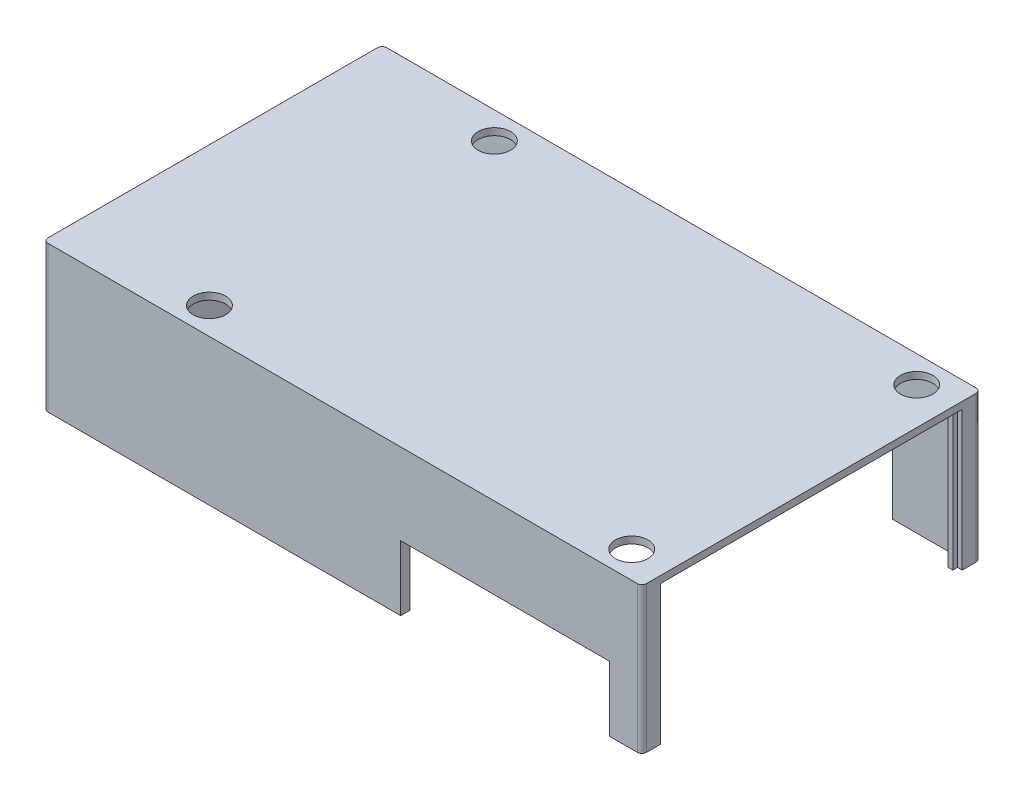
ISO-10303-21;
HEADER;
FILE_DESCRIPTION(('STEP AP214'),'2;1');
FILE_NAME('part.step','',(''),(''),'','','');
FILE_SCHEMA(('AUTOMOTIVE_DESIGN { 1 0 10303 214 1 1 1 1 }'));
ENDSEC;
DATA;
#1=APPLICATION_CONTEXT('core data for automotive mechanical design processes');
#2=APPLICATION_PROTOCOL_DEFINITION('international standard','automotive_design',2000,#1);
#3=PRODUCT_CONTEXT('',#1,'mechanical');
#4=PRODUCT('Part','Part','',(#3));
#5=PRODUCT_RELATED_PRODUCT_CATEGORY('part','',(#4));
#6=PRODUCT_DEFINITION_FORMATION('','',#4);
#7=PRODUCT_DEFINITION_CONTEXT('part definition',#1,'design');
#8=PRODUCT_DEFINITION('design','',#6,#7);
#9=PRODUCT_DEFINITION_SHAPE('','',#8);
#10=(LENGTH_UNIT() NAMED_UNIT(*) SI_UNIT(.MILLI.,.METRE.));
#11=(NAMED_UNIT(*) PLANE_ANGLE_UNIT() SI_UNIT($,.RADIAN.));
#12=(NAMED_UNIT(*) SI_UNIT($,.STERADIAN.) SOLID_ANGLE_UNIT());
#13=UNCERTAINTY_MEASURE_WITH_UNIT(LENGTH_MEASURE(1.E-05),#10,'distance_accuracy_value','');
#14=(GEOMETRIC_REPRESENTATION_CONTEXT(3) GLOBAL_UNCERTAINTY_ASSIGNED_CONTEXT((#13)) GLOBAL_UNIT_ASSIGNED_CONTEXT((#10,
#11,#12)) REPRESENTATION_CONTEXT('',''));
#15=CARTESIAN_POINT('',(0.,0.,0.));
#16=DIRECTION('',(0.,0.,1.));
#17=DIRECTION('',(1.,0.,0.));
#18=AXIS2_PLACEMENT_3D('',#15,#16,#17);
#19=CARTESIAN_POINT('',(0.,0.,0.));
#20=DIRECTION('',(0.,-1.,0.));
#21=DIRECTION('',(0.,0.,-1.));
#22=AXIS2_PLACEMENT_3D('',#19,#20,#21);
#23=PLANE('',#22);
#24=CARTESIAN_POINT('',(56.5,0.,-30.7));
#25=DIRECTION('',(0.,-1.,0.));
#26=DIRECTION('',(0.,0.,-1.));
#27=AXIS2_PLACEMENT_3D('',#24,#25,#26);
#28=CIRCLE('',#27,3.5);
#29=CARTESIAN_POINT('',(56.5,0.,-34.2));
#30=VERTEX_POINT('',#29);
#31=EDGE_CURVE('E357',#30,#30,#28,.T.);
#32=ORIENTED_EDGE('',*,*,#31,.F.);
#33=EDGE_LOOP('',(#32));
#34=FACE_BOUND('',#33,.T.);
#35=CARTESIAN_POINT('',(-34.5,0.,30.7));
#36=DIRECTION('',(0.,-1.,0.));
#37=DIRECTION('',(0.,0.,-1.));
#38=AXIS2_PLACEMENT_3D('',#35,#36,#37);
#39=CIRCLE('',#38,3.5);
#40=CARTESIAN_POINT('',(-34.5,0.,27.2));
#41=VERTEX_POINT('',#40);
#42=EDGE_CURVE('E353',#41,#41,#39,.T.);
#43=ORIENTED_EDGE('',*,*,#42,.F.);
#44=EDGE_LOOP('',(#43));
#45=FACE_BOUND('',#44,.T.);
#46=CARTESIAN_POINT('',(56.5,0.,30.7));
#47=DIRECTION('',(0.,-1.,0.));
#48=DIRECTION('',(0.,0.,-1.));
#49=AXIS2_PLACEMENT_3D('',#46,#47,#48);
#50=CIRCLE('',#49,3.50000000000001);
#51=CARTESIAN_POINT('',(56.5,0.,27.2));
#52=VERTEX_POINT('',#51);
#53=EDGE_CURVE('E349',#52,#52,#50,.T.);
#54=ORIENTED_EDGE('',*,*,#53,.F.);
#55=EDGE_LOOP('',(#54));
#56=FACE_BOUND('',#55,.T.);
#57=CARTESIAN_POINT('',(-34.5,0.,-30.7));
#58=DIRECTION('',(0.,-1.,0.));
#59=DIRECTION('',(0.,0.,-1.));
#60=AXIS2_PLACEMENT_3D('',#57,#58,#59);
#61=CIRCLE('',#60,3.5);
#62=CARTESIAN_POINT('',(-34.5,0.,-34.2));
#63=VERTEX_POINT('',#62);
#64=EDGE_CURVE('E345',#63,#63,#61,.T.);
#65=ORIENTED_EDGE('',*,*,#64,.F.);
#66=EDGE_LOOP('',(#65));
#67=FACE_BOUND('',#66,.T.);
#68=DIRECTION('',(0.,0.,1.));
#69=VECTOR('',#68,1.);
#70=CARTESIAN_POINT('',(63.5,0.,-31.5));
#71=LINE('',#70,#69);
#72=CARTESIAN_POINT('',(63.5,0.,-32.5));
#73=VERTEX_POINT('',#72);
#74=CARTESIAN_POINT('',(63.5,0.,-31.5));
#75=VERTEX_POINT('',#74);
#76=EDGE_CURVE('E55',#73,#75,#71,.T.);
#77=ORIENTED_EDGE('',*,*,#76,.F.);
#78=DIRECTION('',(-1.,0.,0.));
#79=VECTOR('',#78,1.);
#80=CARTESIAN_POINT('',(63.5,0.,-32.5));
#81=LINE('',#80,#79);
#82=CARTESIAN_POINT('',(64.5,0.,-32.5));
#83=VERTEX_POINT('',#82);
#84=EDGE_CURVE('E267',#83,#73,#81,.T.);
#85=ORIENTED_EDGE('',*,*,#84,.F.);
#86=DIRECTION('',(0.,0.,1.));
#87=VECTOR('',#86,1.);
#88=CARTESIAN_POINT('',(64.5,0.,-36.5));
#89=LINE('',#88,#87);
#90=CARTESIAN_POINT('',(64.5,0.,32.5));
#91=VERTEX_POINT('',#90);
#92=EDGE_CURVE('E240',#83,#91,#89,.T.);
#93=ORIENTED_EDGE('',*,*,#92,.T.);
#94=DIRECTION('',(1.,0.,0.));
#95=VECTOR('',#94,1.);
#96=CARTESIAN_POINT('',(63.5,0.,32.5));
#97=LINE('',#96,#95);
#98=CARTESIAN_POINT('',(63.5,0.,32.5));
#99=VERTEX_POINT('',#98);
#100=EDGE_CURVE('E290',#99,#91,#97,.T.);
#101=ORIENTED_EDGE('',*,*,#100,.F.);
#102=DIRECTION('',(0.,0.,1.));
#103=VECTOR('',#102,1.);
#104=CARTESIAN_POINT('',(63.5,0.,31.5));
#105=LINE('',#104,#103);
#106=CARTESIAN_POINT('',(63.5,0.,31.5));
#107=VERTEX_POINT('',#106);
#108=EDGE_CURVE('E306',#107,#99,#105,.T.);
#109=ORIENTED_EDGE('',*,*,#108,.F.);
#110=DIRECTION('',(1.,0.,0.));
#111=VECTOR('',#110,1.);
#112=CARTESIAN_POINT('',(62.5,0.,31.5));
#113=LINE('',#112,#111);
#114=CARTESIAN_POINT('',(62.5,0.,31.5));
#115=VERTEX_POINT('',#114);
#116=EDGE_CURVE('E303',#115,#107,#113,.T.);
#117=ORIENTED_EDGE('',*,*,#116,.F.);
#118=DIRECTION('',(0.,0.,-1.));
#119=VECTOR('',#118,1.);
#120=CARTESIAN_POINT('',(62.5,0.,34.5));
#121=LINE('',#120,#119);
#122=CARTESIAN_POINT('',(62.5,0.,34.5));
#123=VERTEX_POINT('',#122);
#124=EDGE_CURVE('E243',#123,#115,#121,.T.);
#125=ORIENTED_EDGE('',*,*,#124,.F.);
#126=DIRECTION('',(1.,0.,0.));
#127=VECTOR('',#126,1.);
#128=CARTESIAN_POINT('',(-64.5,0.,34.5));
#129=LINE('',#128,#127);
#130=CARTESIAN_POINT('',(-62.5,0.,34.5));
#131=VERTEX_POINT('',#130);
#132=EDGE_CURVE('E422',#131,#123,#129,.T.);
#133=ORIENTED_EDGE('',*,*,#132,.F.);
#134=DIRECTION('',(0.,0.,-1.));
#135=VECTOR('',#134,1.);
#136=CARTESIAN_POINT('',(-62.5,0.,34.5));
#137=LINE('',#136,#135);
#138=CARTESIAN_POINT('',(-62.5,0.,-34.5));
#139=VERTEX_POINT('',#138);
#140=EDGE_CURVE('E458',#131,#139,#137,.T.);
#141=ORIENTED_EDGE('',*,*,#140,.T.);
#142=DIRECTION('',(1.,0.,0.));
#143=VECTOR('',#142,1.);
#144=CARTESIAN_POINT('',(-64.5,0.,-34.5));
#145=LINE('',#144,#143);
#146=CARTESIAN_POINT('',(62.5,0.,-34.5));
#147=VERTEX_POINT('',#146);
#148=EDGE_CURVE('E447',#139,#147,#145,.T.);
#149=ORIENTED_EDGE('',*,*,#148,.T.);
#150=DIRECTION('',(0.,0.,-1.));
#151=VECTOR('',#150,1.);
#152=CARTESIAN_POINT('',(62.5,0.,-34.5));
#153=LINE('',#152,#151);
#154=CARTESIAN_POINT('',(62.5,0.,-31.5));
#155=VERTEX_POINT('',#154);
#156=EDGE_CURVE('E251',#155,#147,#153,.T.);
#157=ORIENTED_EDGE('',*,*,#156,.F.);
#158=DIRECTION('',(-1.,0.,0.));
#159=VECTOR('',#158,1.);
#160=CARTESIAN_POINT('',(62.5,0.,-31.5));
#161=LINE('',#160,#159);
#162=EDGE_CURVE('E60',#75,#155,#161,.T.);
#163=ORIENTED_EDGE('',*,*,#162,.F.);
#164=EDGE_LOOP('',(#77,#85,#93,#101,#109,#117,#125,#133,#141,#149,#157,#163));
#165=FACE_BOUND('',#164,.T.);
#166=ADVANCED_FACE('F39',(#34,#45,#56,#67,#165),#23,.T.);
#167=CARTESIAN_POINT('',(-64.5,-30.,-34.5));
#168=DIRECTION('',(0.,0.,1.));
#169=DIRECTION('',(1.,0.,0.));
#170=AXIS2_PLACEMENT_3D('',#167,#168,#169);
#171=PLANE('',#170);
#172=DIRECTION('',(1.,0.,0.));
#173=VECTOR('',#172,1.);
#174=CARTESIAN_POINT('',(-64.5,-30.,-34.5));
#175=LINE('',#174,#173);
#176=CARTESIAN_POINT('',(47.5,-30.,-34.5));
#177=VERTEX_POINT('',#176);
#178=CARTESIAN_POINT('',(62.5,-30.,-34.5));
#179=VERTEX_POINT('',#178);
#180=EDGE_CURVE('E232',#177,#179,#175,.T.);
#181=ORIENTED_EDGE('',*,*,#180,.T.);
#182=DIRECTION('',(0.,1.,0.));
#183=VECTOR('',#182,1.);
#184=CARTESIAN_POINT('',(62.5,-30.,-34.5));
#185=LINE('',#184,#183);
#186=EDGE_CURVE('E266',#179,#147,#185,.T.);
#187=ORIENTED_EDGE('',*,*,#186,.T.);
#188=ORIENTED_EDGE('',*,*,#148,.F.);
#189=DIRECTION('',(0.,1.,0.));
#190=VECTOR('',#189,1.);
#191=CARTESIAN_POINT('',(-62.5,-30.,-34.5));
#192=LINE('',#191,#190);
#193=CARTESIAN_POINT('',(-62.5,-30.,-34.5));
#194=VERTEX_POINT('',#193);
#195=EDGE_CURVE('E473',#194,#139,#192,.T.);
#196=ORIENTED_EDGE('',*,*,#195,.F.);
#197=CARTESIAN_POINT('',(27.5,-30.,-34.5));
#198=VERTEX_POINT('',#197);
#199=EDGE_CURVE('E454',#194,#198,#175,.T.);
#200=ORIENTED_EDGE('',*,*,#199,.T.);
#201=DIRECTION('',(0.,-1.,0.));
#202=VECTOR('',#201,1.);
#203=CARTESIAN_POINT('',(27.5,-16.,-34.5));
#204=LINE('',#203,#202);
#205=CARTESIAN_POINT('',(27.5,-16.,-34.5));
#206=VERTEX_POINT('',#205);
#207=EDGE_CURVE('E392',#206,#198,#204,.T.);
#208=ORIENTED_EDGE('',*,*,#207,.F.);
#209=DIRECTION('',(-1.,0.,0.));
#210=VECTOR('',#209,1.);
#211=CARTESIAN_POINT('',(47.5,-16.,-34.5));
#212=LINE('',#211,#210);
#213=CARTESIAN_POINT('',(47.5,-16.,-34.5));
#214=VERTEX_POINT('',#213);
#215=EDGE_CURVE('E365',#214,#206,#212,.T.);
#216=ORIENTED_EDGE('',*,*,#215,.F.);
#217=DIRECTION('',(0.,-1.,0.));
#218=VECTOR('',#217,1.);
#219=CARTESIAN_POINT('',(47.5,-16.,-34.5));
#220=LINE('',#219,#218);
#221=EDGE_CURVE('E378',#214,#177,#220,.T.);
#222=ORIENTED_EDGE('',*,*,#221,.T.);
#223=EDGE_LOOP('',(#181,#187,#188,#196,#200,#208,#216,#222));
#224=FACE_BOUND('',#223,.T.);
#225=ADVANCED_FACE('F595',(#224),#171,.T.);
#226=CARTESIAN_POINT('',(-64.5,-30.,34.5));
#227=DIRECTION('',(0.,0.,1.));
#228=DIRECTION('',(1.,0.,0.));
#229=AXIS2_PLACEMENT_3D('',#226,#227,#228);
#230=PLANE('',#229);
#231=DIRECTION('',(0.,1.,0.));
#232=VECTOR('',#231,1.);
#233=CARTESIAN_POINT('',(62.5,-30.,34.5));
#234=LINE('',#233,#232);
#235=CARTESIAN_POINT('',(62.5,-30.,34.5));
#236=VERTEX_POINT('',#235);
#237=EDGE_CURVE('E326',#236,#123,#234,.T.);
#238=ORIENTED_EDGE('',*,*,#237,.F.);
#239=DIRECTION('',(1.,0.,0.));
#240=VECTOR('',#239,1.);
#241=CARTESIAN_POINT('',(-64.5,-30.,34.5));
#242=LINE('',#241,#240);
#243=CARTESIAN_POINT('',(57.5,-30.,34.5));
#244=VERTEX_POINT('',#243);
#245=EDGE_CURVE('E442',#244,#236,#242,.T.);
#246=ORIENTED_EDGE('',*,*,#245,.F.);
#247=DIRECTION('',(0.,-1.,0.));
#248=VECTOR('',#247,1.);
#249=CARTESIAN_POINT('',(57.5,-16.,34.5));
#250=LINE('',#249,#248);
#251=CARTESIAN_POINT('',(57.5,-16.,34.5));
#252=VERTEX_POINT('',#251);
#253=EDGE_CURVE('E419',#252,#244,#250,.T.);
#254=ORIENTED_EDGE('',*,*,#253,.F.);
#255=DIRECTION('',(1.,0.,0.));
#256=VECTOR('',#255,1.);
#257=CARTESIAN_POINT('',(57.5,-16.,34.5));
#258=LINE('',#257,#256);
#259=CARTESIAN_POINT('',(12.5,-16.,34.5));
#260=VERTEX_POINT('',#259);
#261=EDGE_CURVE('E410',#260,#252,#258,.T.);
#262=ORIENTED_EDGE('',*,*,#261,.F.);
#263=DIRECTION('',(0.,-1.,0.));
#264=VECTOR('',#263,1.);
#265=CARTESIAN_POINT('',(12.5,-16.,34.5));
#266=LINE('',#265,#264);
#267=CARTESIAN_POINT('',(12.5,-30.,34.5));
#268=VERTEX_POINT('',#267);
#269=EDGE_CURVE('E423',#260,#268,#266,.T.);
#270=ORIENTED_EDGE('',*,*,#269,.T.);
#271=CARTESIAN_POINT('',(-62.5,-30.,34.5));
#272=VERTEX_POINT('',#271);
#273=EDGE_CURVE('E443',#272,#268,#242,.T.);
#274=ORIENTED_EDGE('',*,*,#273,.F.);
#275=DIRECTION('',(0.,1.,0.));
#276=VECTOR('',#275,1.);
#277=CARTESIAN_POINT('',(-62.5,-30.,34.5));
#278=LINE('',#277,#276);
#279=EDGE_CURVE('E469',#272,#131,#278,.T.);
#280=ORIENTED_EDGE('',*,*,#279,.T.);
#281=ORIENTED_EDGE('',*,*,#132,.T.);
#282=EDGE_LOOP('',(#238,#246,#254,#262,#270,#274,#280,#281));
#283=FACE_BOUND('',#282,.T.);
#284=ADVANCED_FACE('F636',(#283),#230,.F.);
#285=CARTESIAN_POINT('',(0.,-30.,0.));
#286=DIRECTION('',(0.,1.,0.));
#287=DIRECTION('',(0.,0.,1.));
#288=AXIS2_PLACEMENT_3D('',#285,#286,#287);
#289=PLANE('',#288);
#290=DIRECTION('',(1.,0.,0.));
#291=VECTOR('',#290,1.);
#292=CARTESIAN_POINT('',(-64.5,-30.,-36.5));
#293=LINE('',#292,#291);
#294=CARTESIAN_POINT('',(47.5,-30.,-36.5));
#295=VERTEX_POINT('',#294);
#296=CARTESIAN_POINT('',(63.5,-30.,-36.5));
#297=VERTEX_POINT('',#296);
#298=EDGE_CURVE('E452',#295,#297,#293,.T.);
#299=ORIENTED_EDGE('',*,*,#298,.T.);
#300=CARTESIAN_POINT('',(63.5,-30.,-35.5));
#301=DIRECTION('',(0.,1.,0.));
#302=DIRECTION('',(0.,0.,1.));
#303=AXIS2_PLACEMENT_3D('',#300,#301,#302);
#304=CIRCLE('',#303,1.);
#305=CARTESIAN_POINT('',(64.5,-30.,-35.5));
#306=VERTEX_POINT('',#305);
#307=EDGE_CURVE('E228',#297,#306,#304,.F.);
#308=ORIENTED_EDGE('',*,*,#307,.T.);
#309=DIRECTION('',(0.,0.,-1.));
#310=VECTOR('',#309,1.);
#311=CARTESIAN_POINT('',(64.5,-30.,-34.5));
#312=LINE('',#311,#310);
#313=CARTESIAN_POINT('',(64.5,-30.,-32.5));
#314=VERTEX_POINT('',#313);
#315=EDGE_CURVE('E221',#314,#306,#312,.T.);
#316=ORIENTED_EDGE('',*,*,#315,.F.);
#317=DIRECTION('',(-1.,0.,0.));
#318=VECTOR('',#317,1.);
#319=CARTESIAN_POINT('',(63.5,-30.,-32.5));
#320=LINE('',#319,#318);
#321=CARTESIAN_POINT('',(63.5,-30.,-32.5));
#322=VERTEX_POINT('',#321);
#323=EDGE_CURVE('E226',#314,#322,#320,.T.);
#324=ORIENTED_EDGE('',*,*,#323,.T.);
#325=DIRECTION('',(0.,0.,1.));
#326=VECTOR('',#325,1.);
#327=CARTESIAN_POINT('',(63.5,-30.,-31.5));
#328=LINE('',#327,#326);
#329=CARTESIAN_POINT('',(63.5,-30.,-31.5));
#330=VERTEX_POINT('',#329);
#331=EDGE_CURVE('E250',#322,#330,#328,.T.);
#332=ORIENTED_EDGE('',*,*,#331,.T.);
#333=DIRECTION('',(-1.,0.,0.));
#334=VECTOR('',#333,1.);
#335=CARTESIAN_POINT('',(62.5,-30.,-31.5));
#336=LINE('',#335,#334);
#337=CARTESIAN_POINT('',(62.5,-30.,-31.5));
#338=VERTEX_POINT('',#337);
#339=EDGE_CURVE('E255',#330,#338,#336,.T.);
#340=ORIENTED_EDGE('',*,*,#339,.T.);
#341=DIRECTION('',(0.,0.,-1.));
#342=VECTOR('',#341,1.);
#343=CARTESIAN_POINT('',(62.5,-30.,-34.5));
#344=LINE('',#343,#342);
#345=EDGE_CURVE('E262',#338,#179,#344,.T.);
#346=ORIENTED_EDGE('',*,*,#345,.T.);
#347=ORIENTED_EDGE('',*,*,#180,.F.);
#348=DIRECTION('',(0.,0.,1.));
#349=VECTOR('',#348,1.);
#350=CARTESIAN_POINT('',(47.5,-30.,-34.5));
#351=LINE('',#350,#349);
#352=EDGE_CURVE('E361',#295,#177,#351,.T.);
#353=ORIENTED_EDGE('',*,*,#352,.F.);
#354=EDGE_LOOP('',(#299,#308,#316,#324,#332,#340,#346,#347,#353));
#355=FACE_BOUND('',#354,.T.);
#356=ADVANCED_FACE('F224',(#355),#289,.F.);
#357=DIRECTION('',(0.,0.,1.));
#358=VECTOR('',#357,1.);
#359=CARTESIAN_POINT('',(64.5,-30.,34.5));
#360=LINE('',#359,#358);
#361=CARTESIAN_POINT('',(64.5,-30.,32.5));
#362=VERTEX_POINT('',#361);
#363=CARTESIAN_POINT('',(64.5,-30.,35.5));
#364=VERTEX_POINT('',#363);
#365=EDGE_CURVE('E437',#362,#364,#360,.T.);
#366=ORIENTED_EDGE('',*,*,#365,.T.);
#367=CARTESIAN_POINT('',(63.5,-30.,35.5));
#368=DIRECTION('',(0.,1.,0.));
#369=DIRECTION('',(0.,0.,1.));
#370=AXIS2_PLACEMENT_3D('',#367,#368,#369);
#371=CIRCLE('',#370,1.);
#372=CARTESIAN_POINT('',(63.5,-30.,36.5));
#373=VERTEX_POINT('',#372);
#374=EDGE_CURVE('E527',#364,#373,#371,.F.);
#375=ORIENTED_EDGE('',*,*,#374,.T.);
#376=DIRECTION('',(1.,0.,0.));
#377=VECTOR('',#376,1.);
#378=CARTESIAN_POINT('',(-64.5,-30.,36.5));
#379=LINE('',#378,#377);
#380=CARTESIAN_POINT('',(57.5,-30.,36.5));
#381=VERTEX_POINT('',#380);
#382=EDGE_CURVE('E438',#381,#373,#379,.T.);
#383=ORIENTED_EDGE('',*,*,#382,.F.);
#384=DIRECTION('',(0.,0.,1.));
#385=VECTOR('',#384,1.);
#386=CARTESIAN_POINT('',(57.5,-30.,36.5));
#387=LINE('',#386,#385);
#388=EDGE_CURVE('E387',#244,#381,#387,.T.);
#389=ORIENTED_EDGE('',*,*,#388,.F.);
#390=ORIENTED_EDGE('',*,*,#245,.T.);
#391=DIRECTION('',(0.,0.,-1.));
#392=VECTOR('',#391,1.);
#393=CARTESIAN_POINT('',(62.5,-30.,34.5));
#394=LINE('',#393,#392);
#395=CARTESIAN_POINT('',(62.5,-30.,31.5));
#396=VERTEX_POINT('',#395);
#397=EDGE_CURVE('E286',#236,#396,#394,.T.);
#398=ORIENTED_EDGE('',*,*,#397,.T.);
#399=DIRECTION('',(1.,0.,0.));
#400=VECTOR('',#399,1.);
#401=CARTESIAN_POINT('',(62.5,-30.,31.5));
#402=LINE('',#401,#400);
#403=CARTESIAN_POINT('',(63.5,-30.,31.5));
#404=VERTEX_POINT('',#403);
#405=EDGE_CURVE('E289',#396,#404,#402,.T.);
#406=ORIENTED_EDGE('',*,*,#405,.T.);
#407=DIRECTION('',(0.,0.,1.));
#408=VECTOR('',#407,1.);
#409=CARTESIAN_POINT('',(63.5,-30.,31.5));
#410=LINE('',#409,#408);
#411=CARTESIAN_POINT('',(63.5,-30.,32.5));
#412=VERTEX_POINT('',#411);
#413=EDGE_CURVE('E293',#404,#412,#410,.T.);
#414=ORIENTED_EDGE('',*,*,#413,.T.);
#415=DIRECTION('',(1.,0.,0.));
#416=VECTOR('',#415,1.);
#417=CARTESIAN_POINT('',(63.5,-30.,32.5));
#418=LINE('',#417,#416);
#419=EDGE_CURVE('E296',#412,#362,#418,.T.);
#420=ORIENTED_EDGE('',*,*,#419,.T.);
#421=EDGE_LOOP('',(#366,#375,#383,#389,#390,#398,#406,#414,#420));
#422=FACE_BOUND('',#421,.T.);
#423=ADVANCED_FACE('F573',(#422),#289,.F.);
#424=CARTESIAN_POINT('',(-64.5,1.5,-36.5));
#425=DIRECTION('',(0.,0.,-1.));
#426=DIRECTION('',(-1.,0.,0.));
#427=AXIS2_PLACEMENT_3D('',#424,#425,#426);
#428=PLANE('',#427);
#429=DIRECTION('',(1.,0.,0.));
#430=VECTOR('',#429,1.);
#431=CARTESIAN_POINT('',(-64.5,1.5,-36.5));
#432=LINE('',#431,#430);
#433=CARTESIAN_POINT('',(-63.5,1.5,-36.5));
#434=VERTEX_POINT('',#433);
#435=CARTESIAN_POINT('',(63.5,1.5,-36.5));
#436=VERTEX_POINT('',#435);
#437=EDGE_CURVE('E480',#434,#436,#432,.T.);
#438=ORIENTED_EDGE('',*,*,#437,.T.);
#439=DIRECTION('',(0.,-1.,0.));
#440=VECTOR('',#439,1.);
#441=CARTESIAN_POINT('',(63.5,1.5,-36.5));
#442=LINE('',#441,#440);
#443=EDGE_CURVE('E537',#436,#297,#442,.T.);
#444=ORIENTED_EDGE('',*,*,#443,.T.);
#445=ORIENTED_EDGE('',*,*,#298,.F.);
#446=DIRECTION('',(0.,-1.,0.));
#447=VECTOR('',#446,1.);
#448=CARTESIAN_POINT('',(47.5,-16.,-36.5));
#449=LINE('',#448,#447);
#450=CARTESIAN_POINT('',(47.5,-16.,-36.5));
#451=VERTEX_POINT('',#450);
#452=EDGE_CURVE('E384',#451,#295,#449,.T.);
#453=ORIENTED_EDGE('',*,*,#452,.F.);
#454=DIRECTION('',(1.,0.,0.));
#455=VECTOR('',#454,1.);
#456=CARTESIAN_POINT('',(47.5,-16.,-36.5));
#457=LINE('',#456,#455);
#458=CARTESIAN_POINT('',(27.5,-16.,-36.5));
#459=VERTEX_POINT('',#458);
#460=EDGE_CURVE('E374',#459,#451,#457,.T.);
#461=ORIENTED_EDGE('',*,*,#460,.F.);
#462=DIRECTION('',(0.,-1.,0.));
#463=VECTOR('',#462,1.);
#464=CARTESIAN_POINT('',(27.5,-16.,-36.5));
#465=LINE('',#464,#463);
#466=CARTESIAN_POINT('',(27.5,-30.,-36.5));
#467=VERTEX_POINT('',#466);
#468=EDGE_CURVE('E388',#459,#467,#465,.T.);
#469=ORIENTED_EDGE('',*,*,#468,.T.);
#470=CARTESIAN_POINT('',(-63.5,-30.,-36.5));
#471=VERTEX_POINT('',#470);
#472=EDGE_CURVE('E233',#471,#467,#293,.T.);
#473=ORIENTED_EDGE('',*,*,#472,.F.);
#474=DIRECTION('',(0.,-1.,0.));
#475=VECTOR('',#474,1.);
#476=CARTESIAN_POINT('',(-63.5,1.5,-36.5));
#477=LINE('',#476,#475);
#478=EDGE_CURVE('E504',#471,#434,#477,.F.);
#479=ORIENTED_EDGE('',*,*,#478,.T.);
#480=EDGE_LOOP('',(#438,#444,#445,#453,#461,#469,#473,#479));
#481=FACE_BOUND('',#480,.T.);
#482=ADVANCED_FACE('F554',(#481),#428,.T.);
#483=CARTESIAN_POINT('',(-64.5,1.5,-36.5));
#484=DIRECTION('',(1.,0.,0.));
#485=DIRECTION('',(0.,0.,-1.));
#486=AXIS2_PLACEMENT_3D('',#483,#484,#485);
#487=PLANE('',#486);
#488=DIRECTION('',(0.,0.,-1.));
#489=VECTOR('',#488,1.);
#490=CARTESIAN_POINT('',(-64.5,-30.,34.5));
#491=LINE('',#490,#489);
#492=CARTESIAN_POINT('',(-64.5,-30.,35.5));
#493=VERTEX_POINT('',#492);
#494=CARTESIAN_POINT('',(-64.5,-30.,-35.5));
#495=VERTEX_POINT('',#494);
#496=EDGE_CURVE('E466',#493,#495,#491,.T.);
#497=ORIENTED_EDGE('',*,*,#496,.F.);
#498=DIRECTION('',(0.,-1.,0.));
#499=VECTOR('',#498,1.);
#500=CARTESIAN_POINT('',(-64.5,1.5,35.5));
#501=LINE('',#500,#499);
#502=CARTESIAN_POINT('',(-64.5,1.5,35.5));
#503=VERTEX_POINT('',#502);
#504=EDGE_CURVE('E517',#493,#503,#501,.F.);
#505=ORIENTED_EDGE('',*,*,#504,.T.);
#506=DIRECTION('',(0.,0.,1.));
#507=VECTOR('',#506,1.);
#508=CARTESIAN_POINT('',(-64.5,1.5,-36.5));
#509=LINE('',#508,#507);
#510=CARTESIAN_POINT('',(-64.5,1.5,-35.5));
#511=VERTEX_POINT('',#510);
#512=EDGE_CURVE('E491',#511,#503,#509,.T.);
#513=ORIENTED_EDGE('',*,*,#512,.F.);
#514=DIRECTION('',(0.,-1.,0.));
#515=VECTOR('',#514,1.);
#516=CARTESIAN_POINT('',(-64.5,-30.,-35.5));
#517=LINE('',#516,#515);
#518=EDGE_CURVE('E495',#511,#495,#517,.T.);
#519=ORIENTED_EDGE('',*,*,#518,.T.);
#520=EDGE_LOOP('',(#497,#505,#513,#519));
#521=FACE_BOUND('',#520,.T.);
#522=ADVANCED_FACE('F643',(#521),#487,.F.);
#523=CARTESIAN_POINT('',(-64.5,1.5,36.5));
#524=DIRECTION('',(0.,0.,-1.));
#525=DIRECTION('',(-1.,0.,0.));
#526=AXIS2_PLACEMENT_3D('',#523,#524,#525);
#527=PLANE('',#526);
#528=ORIENTED_EDGE('',*,*,#382,.T.);
#529=DIRECTION('',(0.,-1.,0.));
#530=VECTOR('',#529,1.);
#531=CARTESIAN_POINT('',(63.5,1.5,36.5));
#532=LINE('',#531,#530);
#533=CARTESIAN_POINT('',(63.5,1.5,36.5));
#534=VERTEX_POINT('',#533);
#535=EDGE_CURVE('E530',#373,#534,#532,.F.);
#536=ORIENTED_EDGE('',*,*,#535,.T.);
#537=DIRECTION('',(1.,0.,0.));
#538=VECTOR('',#537,1.);
#539=CARTESIAN_POINT('',(-64.5,1.5,36.5));
#540=LINE('',#539,#538);
#541=CARTESIAN_POINT('',(-63.5,1.5,36.5));
#542=VERTEX_POINT('',#541);
#543=EDGE_CURVE('E487',#542,#534,#540,.T.);
#544=ORIENTED_EDGE('',*,*,#543,.F.);
#545=DIRECTION('',(0.,-1.,0.));
#546=VECTOR('',#545,1.);
#547=CARTESIAN_POINT('',(-63.5,1.5,36.5));
#548=LINE('',#547,#546);
#549=CARTESIAN_POINT('',(-63.5,-30.,36.5));
#550=VERTEX_POINT('',#549);
#551=EDGE_CURVE('E510',#542,#550,#548,.T.);
#552=ORIENTED_EDGE('',*,*,#551,.T.);
#553=CARTESIAN_POINT('',(12.5,-30.,36.5));
#554=VERTEX_POINT('',#553);
#555=EDGE_CURVE('E434',#550,#554,#379,.T.);
#556=ORIENTED_EDGE('',*,*,#555,.T.);
#557=DIRECTION('',(0.,-1.,0.));
#558=VECTOR('',#557,1.);
#559=CARTESIAN_POINT('',(12.5,-16.,36.5));
#560=LINE('',#559,#558);
#561=CARTESIAN_POINT('',(12.5,-16.,36.5));
#562=VERTEX_POINT('',#561);
#563=EDGE_CURVE('E427',#562,#554,#560,.T.);
#564=ORIENTED_EDGE('',*,*,#563,.F.);
#565=DIRECTION('',(-1.,0.,0.));
#566=VECTOR('',#565,1.);
#567=CARTESIAN_POINT('',(57.5,-16.,36.5));
#568=LINE('',#567,#566);
#569=CARTESIAN_POINT('',(57.5,-16.,36.5));
#570=VERTEX_POINT('',#569);
#571=EDGE_CURVE('E402',#570,#562,#568,.T.);
#572=ORIENTED_EDGE('',*,*,#571,.F.);
#573=DIRECTION('',(0.,-1.,0.));
#574=VECTOR('',#573,1.);
#575=CARTESIAN_POINT('',(57.5,-16.,36.5));
#576=LINE('',#575,#574);
#577=EDGE_CURVE('E414',#570,#381,#576,.T.);
#578=ORIENTED_EDGE('',*,*,#577,.T.);
#579=EDGE_LOOP('',(#528,#536,#544,#552,#556,#564,#572,#578));
#580=FACE_BOUND('',#579,.T.);
#581=ADVANCED_FACE('F566',(#580),#527,.F.);
#582=CARTESIAN_POINT('',(64.5,1.5,-36.5));
#583=DIRECTION('',(1.,0.,0.));
#584=DIRECTION('',(0.,0.,-1.));
#585=AXIS2_PLACEMENT_3D('',#582,#583,#584);
#586=PLANE('',#585);
#587=ORIENTED_EDGE('',*,*,#92,.F.);
#588=DIRECTION('',(0.,1.,0.));
#589=VECTOR('',#588,1.);
#590=CARTESIAN_POINT('',(64.5,-30.,-32.5));
#591=LINE('',#590,#589);
#592=EDGE_CURVE('E237',#314,#83,#591,.T.);
#593=ORIENTED_EDGE('',*,*,#592,.F.);
#594=ORIENTED_EDGE('',*,*,#315,.T.);
#595=DIRECTION('',(0.,-1.,0.));
#596=VECTOR('',#595,1.);
#597=CARTESIAN_POINT('',(64.5,1.5,-35.5));
#598=LINE('',#597,#596);
#599=CARTESIAN_POINT('',(64.5,1.5,-35.5));
#600=VERTEX_POINT('',#599);
#601=EDGE_CURVE('E48',#306,#600,#598,.F.);
#602=ORIENTED_EDGE('',*,*,#601,.T.);
#603=DIRECTION('',(0.,0.,1.));
#604=VECTOR('',#603,1.);
#605=CARTESIAN_POINT('',(64.5,1.5,-36.5));
#606=LINE('',#605,#604);
#607=CARTESIAN_POINT('',(64.5,1.5,35.5));
#608=VERTEX_POINT('',#607);
#609=EDGE_CURVE('E484',#600,#608,#606,.T.);
#610=ORIENTED_EDGE('',*,*,#609,.T.);
#611=DIRECTION('',(0.,-1.,0.));
#612=VECTOR('',#611,1.);
#613=CARTESIAN_POINT('',(64.5,-30.,35.5));
#614=LINE('',#613,#612);
#615=EDGE_CURVE('E523',#608,#364,#614,.T.);
#616=ORIENTED_EDGE('',*,*,#615,.T.);
#617=ORIENTED_EDGE('',*,*,#365,.F.);
#618=DIRECTION('',(0.,1.,0.));
#619=VECTOR('',#618,1.);
#620=CARTESIAN_POINT('',(64.5,-30.,32.5));
#621=LINE('',#620,#619);
#622=EDGE_CURVE('E300',#362,#91,#621,.T.);
#623=ORIENTED_EDGE('',*,*,#622,.T.);
#624=EDGE_LOOP('',(#587,#593,#594,#602,#610,#616,#617,#623));
#625=FACE_BOUND('',#624,.T.);
#626=ADVANCED_FACE('F238',(#625),#586,.T.);
#627=CARTESIAN_POINT('',(0.,1.5,0.));
#628=DIRECTION('',(0.,-1.,0.));
#629=DIRECTION('',(0.,0.,-1.));
#630=AXIS2_PLACEMENT_3D('',#627,#628,#629);
#631=PLANE('',#630);
#632=CARTESIAN_POINT('',(56.5,1.5,-30.7));
#633=DIRECTION('',(0.,1.,0.));
#634=DIRECTION('',(0.,0.,1.));
#635=AXIS2_PLACEMENT_3D('',#632,#633,#634);
#636=CIRCLE('',#635,3.5);
#637=CARTESIAN_POINT('',(56.5,1.5,-27.2));
#638=VERTEX_POINT('',#637);
#639=EDGE_CURVE('E334',#638,#638,#636,.T.);
#640=ORIENTED_EDGE('',*,*,#639,.F.);
#641=EDGE_LOOP('',(#640));
#642=FACE_BOUND('',#641,.T.);
#643=CARTESIAN_POINT('',(-34.5,1.5,30.7));
#644=DIRECTION('',(0.,1.,0.));
#645=DIRECTION('',(0.,0.,1.));
#646=AXIS2_PLACEMENT_3D('',#643,#644,#645);
#647=CIRCLE('',#646,3.5);
#648=CARTESIAN_POINT('',(-34.5,1.5,34.2));
#649=VERTEX_POINT('',#648);
#650=EDGE_CURVE('E333',#649,#649,#647,.T.);
#651=ORIENTED_EDGE('',*,*,#650,.F.);
#652=EDGE_LOOP('',(#651));
#653=FACE_BOUND('',#652,.T.);
#654=CARTESIAN_POINT('',(56.5,1.5,30.7));
#655=DIRECTION('',(0.,1.,0.));
#656=DIRECTION('',(0.,0.,1.));
#657=AXIS2_PLACEMENT_3D('',#654,#655,#656);
#658=CIRCLE('',#657,3.50000000000001);
#659=CARTESIAN_POINT('',(56.5,1.5,34.2));
#660=VERTEX_POINT('',#659);
#661=EDGE_CURVE('E329',#660,#660,#658,.T.);
#662=ORIENTED_EDGE('',*,*,#661,.F.);
#663=EDGE_LOOP('',(#662));
#664=FACE_BOUND('',#663,.T.);
#665=CARTESIAN_POINT('',(-34.5,1.5,-30.7));
#666=DIRECTION('',(0.,1.,0.));
#667=DIRECTION('',(0.,0.,1.));
#668=AXIS2_PLACEMENT_3D('',#665,#666,#667);
#669=CIRCLE('',#668,3.5);
#670=CARTESIAN_POINT('',(-34.5,1.5,-27.2));
#671=VERTEX_POINT('',#670);
#672=EDGE_CURVE('E338',#671,#671,#669,.T.);
#673=ORIENTED_EDGE('',*,*,#672,.F.);
#674=EDGE_LOOP('',(#673));
#675=FACE_BOUND('',#674,.T.);
#676=ORIENTED_EDGE('',*,*,#609,.F.);
#677=CARTESIAN_POINT('',(63.5,1.5,-35.5));
#678=DIRECTION('',(0.,-1.,0.));
#679=DIRECTION('',(0.,0.,-1.));
#680=AXIS2_PLACEMENT_3D('',#677,#678,#679);
#681=CIRCLE('',#680,1.);
#682=EDGE_CURVE('E11',#600,#436,#681,.F.);
#683=ORIENTED_EDGE('',*,*,#682,.T.);
#684=ORIENTED_EDGE('',*,*,#437,.F.);
#685=CARTESIAN_POINT('',(-63.5,1.5,-35.5));
#686=DIRECTION('',(0.,-1.,0.));
#687=DIRECTION('',(0.,0.,-1.));
#688=AXIS2_PLACEMENT_3D('',#685,#686,#687);
#689=CIRCLE('',#688,1.);
#690=EDGE_CURVE('E507',#434,#511,#689,.F.);
#691=ORIENTED_EDGE('',*,*,#690,.T.);
#692=ORIENTED_EDGE('',*,*,#512,.T.);
#693=CARTESIAN_POINT('',(-63.5,1.5,35.5));
#694=DIRECTION('',(0.,-1.,0.));
#695=DIRECTION('',(0.,0.,-1.));
#696=AXIS2_PLACEMENT_3D('',#693,#694,#695);
#697=CIRCLE('',#696,1.);
#698=EDGE_CURVE('E520',#503,#542,#697,.F.);
#699=ORIENTED_EDGE('',*,*,#698,.T.);
#700=ORIENTED_EDGE('',*,*,#543,.T.);
#701=CARTESIAN_POINT('',(63.5,1.5,35.5));
#702=DIRECTION('',(0.,-1.,0.));
#703=DIRECTION('',(0.,0.,-1.));
#704=AXIS2_PLACEMENT_3D('',#701,#702,#703);
#705=CIRCLE('',#704,1.);
#706=EDGE_CURVE('E533',#534,#608,#705,.F.);
#707=ORIENTED_EDGE('',*,*,#706,.T.);
#708=EDGE_LOOP('',(#676,#683,#684,#691,#692,#699,#700,#707));
#709=FACE_BOUND('',#708,.T.);
#710=ADVANCED_FACE('F547',(#642,#653,#664,#675,#709),#631,.F.);
#711=CARTESIAN_POINT('',(-62.5,-30.,34.5));
#712=DIRECTION('',(1.,0.,0.));
#713=DIRECTION('',(0.,0.,-1.));
#714=AXIS2_PLACEMENT_3D('',#711,#712,#713);
#715=PLANE('',#714);
#716=ORIENTED_EDGE('',*,*,#140,.F.);
#717=ORIENTED_EDGE('',*,*,#279,.F.);
#718=DIRECTION('',(0.,0.,-1.));
#719=VECTOR('',#718,1.);
#720=CARTESIAN_POINT('',(-62.5,-30.,34.5));
#721=LINE('',#720,#719);
#722=EDGE_CURVE('E462',#272,#194,#721,.T.);
#723=ORIENTED_EDGE('',*,*,#722,.T.);
#724=ORIENTED_EDGE('',*,*,#195,.T.);
#725=EDGE_LOOP('',(#716,#717,#723,#724));
#726=FACE_BOUND('',#725,.T.);
#727=ADVANCED_FACE('F601',(#726),#715,.T.);
#728=ORIENTED_EDGE('',*,*,#555,.F.);
#729=CARTESIAN_POINT('',(-63.5,-30.,35.5));
#730=DIRECTION('',(0.,1.,0.));
#731=DIRECTION('',(0.,0.,1.));
#732=AXIS2_PLACEMENT_3D('',#729,#730,#731);
#733=CIRCLE('',#732,1.);
#734=EDGE_CURVE('E514',#550,#493,#733,.F.);
#735=ORIENTED_EDGE('',*,*,#734,.T.);
#736=ORIENTED_EDGE('',*,*,#496,.T.);
#737=CARTESIAN_POINT('',(-63.5,-30.,-35.5));
#738=DIRECTION('',(0.,1.,0.));
#739=DIRECTION('',(0.,0.,1.));
#740=AXIS2_PLACEMENT_3D('',#737,#738,#739);
#741=CIRCLE('',#740,1.);
#742=EDGE_CURVE('E501',#495,#471,#741,.F.);
#743=ORIENTED_EDGE('',*,*,#742,.T.);
#744=ORIENTED_EDGE('',*,*,#472,.T.);
#745=DIRECTION('',(0.,0.,-1.));
#746=VECTOR('',#745,1.);
#747=CARTESIAN_POINT('',(27.5,-30.,-34.5));
#748=LINE('',#747,#746);
#749=EDGE_CURVE('E366',#198,#467,#748,.T.);
#750=ORIENTED_EDGE('',*,*,#749,.F.);
#751=ORIENTED_EDGE('',*,*,#199,.F.);
#752=ORIENTED_EDGE('',*,*,#722,.F.);
#753=ORIENTED_EDGE('',*,*,#273,.T.);
#754=DIRECTION('',(0.,0.,-1.));
#755=VECTOR('',#754,1.);
#756=CARTESIAN_POINT('',(12.5,-30.,36.5));
#757=LINE('',#756,#755);
#758=EDGE_CURVE('E403',#554,#268,#757,.T.);
#759=ORIENTED_EDGE('',*,*,#758,.F.);
#760=EDGE_LOOP('',(#728,#735,#736,#743,#744,#750,#751,#752,#753,#759));
#761=FACE_BOUND('',#760,.T.);
#762=ADVANCED_FACE('F607',(#761),#289,.F.);
#763=CARTESIAN_POINT('',(57.5,-16.,36.5));
#764=DIRECTION('',(1.,0.,0.));
#765=DIRECTION('',(0.,0.,-1.));
#766=AXIS2_PLACEMENT_3D('',#763,#764,#765);
#767=PLANE('',#766);
#768=ORIENTED_EDGE('',*,*,#388,.T.);
#769=ORIENTED_EDGE('',*,*,#577,.F.);
#770=DIRECTION('',(0.,0.,1.));
#771=VECTOR('',#770,1.);
#772=CARTESIAN_POINT('',(57.5,-16.,36.5));
#773=LINE('',#772,#771);
#774=EDGE_CURVE('E398',#252,#570,#773,.T.);
#775=ORIENTED_EDGE('',*,*,#774,.F.);
#776=ORIENTED_EDGE('',*,*,#253,.T.);
#777=EDGE_LOOP('',(#768,#769,#775,#776));
#778=FACE_BOUND('',#777,.T.);
#779=ADVANCED_FACE('F901',(#778),#767,.F.);
#780=CARTESIAN_POINT('',(12.5,-16.,36.5));
#781=DIRECTION('',(-1.,0.,0.));
#782=DIRECTION('',(0.,0.,1.));
#783=AXIS2_PLACEMENT_3D('',#780,#781,#782);
#784=PLANE('',#783);
#785=ORIENTED_EDGE('',*,*,#758,.T.);
#786=ORIENTED_EDGE('',*,*,#269,.F.);
#787=DIRECTION('',(0.,0.,-1.));
#788=VECTOR('',#787,1.);
#789=CARTESIAN_POINT('',(12.5,-16.,36.5));
#790=LINE('',#789,#788);
#791=EDGE_CURVE('E407',#562,#260,#790,.T.);
#792=ORIENTED_EDGE('',*,*,#791,.F.);
#793=ORIENTED_EDGE('',*,*,#563,.T.);
#794=EDGE_LOOP('',(#785,#786,#792,#793));
#795=FACE_BOUND('',#794,.T.);
#796=ADVANCED_FACE('F627',(#795),#784,.F.);
#797=CARTESIAN_POINT('',(0.,-16.,0.));
#798=DIRECTION('',(0.,1.,0.));
#799=DIRECTION('',(0.,0.,1.));
#800=AXIS2_PLACEMENT_3D('',#797,#798,#799);
#801=PLANE('',#800);
#802=ORIENTED_EDGE('',*,*,#774,.T.);
#803=ORIENTED_EDGE('',*,*,#571,.T.);
#804=ORIENTED_EDGE('',*,*,#791,.T.);
#805=ORIENTED_EDGE('',*,*,#261,.T.);
#806=EDGE_LOOP('',(#802,#803,#804,#805));
#807=FACE_BOUND('',#806,.T.);
#808=ADVANCED_FACE('F620',(#807),#801,.F.);
#809=CARTESIAN_POINT('',(47.5,-16.,-34.5));
#810=DIRECTION('',(1.,0.,0.));
#811=DIRECTION('',(0.,0.,-1.));
#812=AXIS2_PLACEMENT_3D('',#809,#810,#811);
#813=PLANE('',#812);
#814=ORIENTED_EDGE('',*,*,#352,.T.);
#815=ORIENTED_EDGE('',*,*,#221,.F.);
#816=DIRECTION('',(0.,0.,1.));
#817=VECTOR('',#816,1.);
#818=CARTESIAN_POINT('',(47.5,-16.,-34.5));
#819=LINE('',#818,#817);
#820=EDGE_CURVE('E362',#451,#214,#819,.T.);
#821=ORIENTED_EDGE('',*,*,#820,.F.);
#822=ORIENTED_EDGE('',*,*,#452,.T.);
#823=EDGE_LOOP('',(#814,#815,#821,#822));
#824=FACE_BOUND('',#823,.T.);
#825=ADVANCED_FACE('F618',(#824),#813,.F.);
#826=CARTESIAN_POINT('',(27.5,-16.,-34.5));
#827=DIRECTION('',(-1.,0.,0.));
#828=DIRECTION('',(0.,0.,1.));
#829=AXIS2_PLACEMENT_3D('',#826,#827,#828);
#830=PLANE('',#829);
#831=ORIENTED_EDGE('',*,*,#749,.T.);
#832=ORIENTED_EDGE('',*,*,#468,.F.);
#833=DIRECTION('',(0.,0.,-1.));
#834=VECTOR('',#833,1.);
#835=CARTESIAN_POINT('',(27.5,-16.,-34.5));
#836=LINE('',#835,#834);
#837=EDGE_CURVE('E370',#206,#459,#836,.T.);
#838=ORIENTED_EDGE('',*,*,#837,.F.);
#839=ORIENTED_EDGE('',*,*,#207,.T.);
#840=EDGE_LOOP('',(#831,#832,#838,#839));
#841=FACE_BOUND('',#840,.T.);
#842=ADVANCED_FACE('F610',(#841),#830,.F.);
#843=CARTESIAN_POINT('',(0.,-16.,0.));
#844=DIRECTION('',(0.,1.,0.));
#845=DIRECTION('',(0.,0.,1.));
#846=AXIS2_PLACEMENT_3D('',#843,#844,#845);
#847=PLANE('',#846);
#848=ORIENTED_EDGE('',*,*,#820,.T.);
#849=ORIENTED_EDGE('',*,*,#215,.T.);
#850=ORIENTED_EDGE('',*,*,#837,.T.);
#851=ORIENTED_EDGE('',*,*,#460,.T.);
#852=EDGE_LOOP('',(#848,#849,#850,#851));
#853=FACE_BOUND('',#852,.T.);
#854=ADVANCED_FACE('F614',(#853),#847,.F.);
#855=CARTESIAN_POINT('',(-63.5,1.5,-35.5));
#856=DIRECTION('',(0.,1.,0.));
#857=DIRECTION('',(0.,0.,1.));
#858=AXIS2_PLACEMENT_3D('',#855,#856,#857);
#859=CYLINDRICAL_SURFACE('',#858,1.);
#860=ORIENTED_EDGE('',*,*,#690,.F.);
#861=ORIENTED_EDGE('',*,*,#478,.F.);
#862=ORIENTED_EDGE('',*,*,#742,.F.);
#863=ORIENTED_EDGE('',*,*,#518,.F.);
#864=EDGE_LOOP('',(#860,#861,#862,#863));
#865=FACE_BOUND('',#864,.T.);
#866=ADVANCED_FACE('F653',(#865),#859,.T.);
#867=CARTESIAN_POINT('',(-63.5,1.5,35.5));
#868=DIRECTION('',(0.,-1.,0.));
#869=DIRECTION('',(0.,0.,-1.));
#870=AXIS2_PLACEMENT_3D('',#867,#868,#869);
#871=CYLINDRICAL_SURFACE('',#870,1.);
#872=ORIENTED_EDGE('',*,*,#698,.F.);
#873=ORIENTED_EDGE('',*,*,#504,.F.);
#874=ORIENTED_EDGE('',*,*,#734,.F.);
#875=ORIENTED_EDGE('',*,*,#551,.F.);
#876=EDGE_LOOP('',(#872,#873,#874,#875));
#877=FACE_BOUND('',#876,.T.);
#878=ADVANCED_FACE('F656',(#877),#871,.T.);
#879=CARTESIAN_POINT('',(63.5,1.5,35.5));
#880=DIRECTION('',(0.,1.,0.));
#881=DIRECTION('',(0.,0.,1.));
#882=AXIS2_PLACEMENT_3D('',#879,#880,#881);
#883=CYLINDRICAL_SURFACE('',#882,1.);
#884=ORIENTED_EDGE('',*,*,#706,.F.);
#885=ORIENTED_EDGE('',*,*,#535,.F.);
#886=ORIENTED_EDGE('',*,*,#374,.F.);
#887=ORIENTED_EDGE('',*,*,#615,.F.);
#888=EDGE_LOOP('',(#884,#885,#886,#887));
#889=FACE_BOUND('',#888,.T.);
#890=ADVANCED_FACE('F572',(#889),#883,.T.);
#891=CARTESIAN_POINT('',(-34.5,-8.5,-30.7));
#892=DIRECTION('',(0.,1.,0.));
#893=DIRECTION('',(0.,0.,1.));
#894=AXIS2_PLACEMENT_3D('',#891,#892,#893);
#895=CYLINDRICAL_SURFACE('',#894,3.5);
#896=ORIENTED_EDGE('',*,*,#64,.T.);
#897=EDGE_LOOP('',(#896));
#898=FACE_BOUND('',#897,.T.);
#899=ORIENTED_EDGE('',*,*,#672,.T.);
#900=EDGE_LOOP('',(#899));
#901=FACE_BOUND('',#900,.T.);
#902=ADVANCED_FACE('F661',(#898,#901),#895,.F.);
#903=CARTESIAN_POINT('',(56.5,-8.5,30.7));
#904=DIRECTION('',(0.,1.,0.));
#905=DIRECTION('',(0.,0.,1.));
#906=AXIS2_PLACEMENT_3D('',#903,#904,#905);
#907=CYLINDRICAL_SURFACE('',#906,3.50000000000001);
#908=ORIENTED_EDGE('',*,*,#53,.T.);
#909=EDGE_LOOP('',(#908));
#910=FACE_BOUND('',#909,.T.);
#911=ORIENTED_EDGE('',*,*,#661,.T.);
#912=EDGE_LOOP('',(#911));
#913=FACE_BOUND('',#912,.T.);
#914=ADVANCED_FACE('F665',(#910,#913),#907,.F.);
#915=CARTESIAN_POINT('',(-34.5,-8.5,30.7));
#916=DIRECTION('',(0.,1.,0.));
#917=DIRECTION('',(0.,0.,1.));
#918=AXIS2_PLACEMENT_3D('',#915,#916,#917);
#919=CYLINDRICAL_SURFACE('',#918,3.5);
#920=ORIENTED_EDGE('',*,*,#42,.T.);
#921=EDGE_LOOP('',(#920));
#922=FACE_BOUND('',#921,.T.);
#923=ORIENTED_EDGE('',*,*,#650,.T.);
#924=EDGE_LOOP('',(#923));
#925=FACE_BOUND('',#924,.T.);
#926=ADVANCED_FACE('F671',(#922,#925),#919,.F.);
#927=CARTESIAN_POINT('',(56.5,-8.5,-30.7));
#928=DIRECTION('',(0.,1.,0.));
#929=DIRECTION('',(0.,0.,1.));
#930=AXIS2_PLACEMENT_3D('',#927,#928,#929);
#931=CYLINDRICAL_SURFACE('',#930,3.5);
#932=ORIENTED_EDGE('',*,*,#31,.T.);
#933=EDGE_LOOP('',(#932));
#934=FACE_BOUND('',#933,.T.);
#935=ORIENTED_EDGE('',*,*,#639,.T.);
#936=EDGE_LOOP('',(#935));
#937=FACE_BOUND('',#936,.T.);
#938=ADVANCED_FACE('F728',(#934,#937),#931,.F.);
#939=CARTESIAN_POINT('',(63.5,1.5,-35.5));
#940=DIRECTION('',(0.,-1.,0.));
#941=DIRECTION('',(0.,0.,-1.));
#942=AXIS2_PLACEMENT_3D('',#939,#940,#941);
#943=CYLINDRICAL_SURFACE('',#942,1.);
#944=ORIENTED_EDGE('',*,*,#682,.F.);
#945=ORIENTED_EDGE('',*,*,#601,.F.);
#946=ORIENTED_EDGE('',*,*,#307,.F.);
#947=ORIENTED_EDGE('',*,*,#443,.F.);
#948=EDGE_LOOP('',(#944,#945,#946,#947));
#949=FACE_BOUND('',#948,.T.);
#950=ADVANCED_FACE('F41',(#949),#943,.T.);
#951=CARTESIAN_POINT('',(62.5,-30.,34.5));
#952=DIRECTION('',(1.,0.,0.));
#953=DIRECTION('',(0.,0.,-1.));
#954=AXIS2_PLACEMENT_3D('',#951,#952,#953);
#955=PLANE('',#954);
#956=ORIENTED_EDGE('',*,*,#124,.T.);
#957=DIRECTION('',(0.,1.,0.));
#958=VECTOR('',#957,1.);
#959=CARTESIAN_POINT('',(62.5,-30.,31.5));
#960=LINE('',#959,#958);
#961=EDGE_CURVE('E322',#396,#115,#960,.T.);
#962=ORIENTED_EDGE('',*,*,#961,.F.);
#963=ORIENTED_EDGE('',*,*,#397,.F.);
#964=ORIENTED_EDGE('',*,*,#237,.T.);
#965=EDGE_LOOP('',(#956,#962,#963,#964));
#966=FACE_BOUND('',#965,.T.);
#967=ADVANCED_FACE('F765',(#966),#955,.F.);
#968=CARTESIAN_POINT('',(62.5,-30.,31.5));
#969=DIRECTION('',(0.,0.,1.));
#970=DIRECTION('',(1.,0.,0.));
#971=AXIS2_PLACEMENT_3D('',#968,#969,#970);
#972=PLANE('',#971);
#973=ORIENTED_EDGE('',*,*,#116,.T.);
#974=DIRECTION('',(0.,1.,0.));
#975=VECTOR('',#974,1.);
#976=CARTESIAN_POINT('',(63.5,-30.,31.5));
#977=LINE('',#976,#975);
#978=EDGE_CURVE('E318',#404,#107,#977,.T.);
#979=ORIENTED_EDGE('',*,*,#978,.F.);
#980=ORIENTED_EDGE('',*,*,#405,.F.);
#981=ORIENTED_EDGE('',*,*,#961,.T.);
#982=EDGE_LOOP('',(#973,#979,#980,#981));
#983=FACE_BOUND('',#982,.T.);
#984=ADVANCED_FACE('F816',(#983),#972,.F.);
#985=CARTESIAN_POINT('',(63.5,-30.,31.5));
#986=DIRECTION('',(-1.,0.,0.));
#987=DIRECTION('',(0.,0.,1.));
#988=AXIS2_PLACEMENT_3D('',#985,#986,#987);
#989=PLANE('',#988);
#990=ORIENTED_EDGE('',*,*,#108,.T.);
#991=DIRECTION('',(0.,1.,0.));
#992=VECTOR('',#991,1.);
#993=CARTESIAN_POINT('',(63.5,-30.,32.5));
#994=LINE('',#993,#992);
#995=EDGE_CURVE('E314',#412,#99,#994,.T.);
#996=ORIENTED_EDGE('',*,*,#995,.F.);
#997=ORIENTED_EDGE('',*,*,#413,.F.);
#998=ORIENTED_EDGE('',*,*,#978,.T.);
#999=EDGE_LOOP('',(#990,#996,#997,#998));
#1000=FACE_BOUND('',#999,.T.);
#1001=ADVANCED_FACE('F826',(#1000),#989,.F.);
#1002=CARTESIAN_POINT('',(63.5,-30.,32.5));
#1003=DIRECTION('',(0.,0.,1.));
#1004=DIRECTION('',(1.,0.,0.));
#1005=AXIS2_PLACEMENT_3D('',#1002,#1003,#1004);
#1006=PLANE('',#1005);
#1007=ORIENTED_EDGE('',*,*,#100,.T.);
#1008=ORIENTED_EDGE('',*,*,#622,.F.);
#1009=ORIENTED_EDGE('',*,*,#419,.F.);
#1010=ORIENTED_EDGE('',*,*,#995,.T.);
#1011=EDGE_LOOP('',(#1007,#1008,#1009,#1010));
#1012=FACE_BOUND('',#1011,.T.);
#1013=ADVANCED_FACE('F579',(#1012),#1006,.F.);
#1014=CARTESIAN_POINT('',(63.5,-30.,-32.5));
#1015=DIRECTION('',(0.,0.,-1.));
#1016=DIRECTION('',(-1.,0.,0.));
#1017=AXIS2_PLACEMENT_3D('',#1014,#1015,#1016);
#1018=PLANE('',#1017);
#1019=ORIENTED_EDGE('',*,*,#84,.T.);
#1020=DIRECTION('',(0.,1.,0.));
#1021=VECTOR('',#1020,1.);
#1022=CARTESIAN_POINT('',(63.5,-30.,-32.5));
#1023=LINE('',#1022,#1021);
#1024=EDGE_CURVE('E244',#322,#73,#1023,.T.);
#1025=ORIENTED_EDGE('',*,*,#1024,.F.);
#1026=ORIENTED_EDGE('',*,*,#323,.F.);
#1027=ORIENTED_EDGE('',*,*,#592,.T.);
#1028=EDGE_LOOP('',(#1019,#1025,#1026,#1027));
#1029=FACE_BOUND('',#1028,.T.);
#1030=ADVANCED_FACE('F246',(#1029),#1018,.F.);
#1031=CARTESIAN_POINT('',(63.5,-30.,-31.5));
#1032=DIRECTION('',(-1.,0.,0.));
#1033=DIRECTION('',(0.,0.,1.));
#1034=AXIS2_PLACEMENT_3D('',#1031,#1032,#1033);
#1035=PLANE('',#1034);
#1036=ORIENTED_EDGE('',*,*,#76,.T.);
#1037=DIRECTION('',(0.,1.,0.));
#1038=VECTOR('',#1037,1.);
#1039=CARTESIAN_POINT('',(63.5,-30.,-31.5));
#1040=LINE('',#1039,#1038);
#1041=EDGE_CURVE('E280',#330,#75,#1040,.T.);
#1042=ORIENTED_EDGE('',*,*,#1041,.F.);
#1043=ORIENTED_EDGE('',*,*,#331,.F.);
#1044=ORIENTED_EDGE('',*,*,#1024,.T.);
#1045=EDGE_LOOP('',(#1036,#1042,#1043,#1044));
#1046=FACE_BOUND('',#1045,.T.);
#1047=ADVANCED_FACE('F584',(#1046),#1035,.F.);
#1048=CARTESIAN_POINT('',(62.5,-30.,-31.5));
#1049=DIRECTION('',(0.,0.,-1.));
#1050=DIRECTION('',(-1.,0.,0.));
#1051=AXIS2_PLACEMENT_3D('',#1048,#1049,#1050);
#1052=PLANE('',#1051);
#1053=ORIENTED_EDGE('',*,*,#162,.T.);
#1054=DIRECTION('',(0.,1.,0.));
#1055=VECTOR('',#1054,1.);
#1056=CARTESIAN_POINT('',(62.5,-30.,-31.5));
#1057=LINE('',#1056,#1055);
#1058=EDGE_CURVE('E276',#338,#155,#1057,.T.);
#1059=ORIENTED_EDGE('',*,*,#1058,.F.);
#1060=ORIENTED_EDGE('',*,*,#339,.F.);
#1061=ORIENTED_EDGE('',*,*,#1041,.T.);
#1062=EDGE_LOOP('',(#1053,#1059,#1060,#1061));
#1063=FACE_BOUND('',#1062,.T.);
#1064=ADVANCED_FACE('F591',(#1063),#1052,.F.);
#1065=CARTESIAN_POINT('',(62.5,-30.,-34.5));
#1066=DIRECTION('',(1.,0.,0.));
#1067=DIRECTION('',(0.,0.,-1.));
#1068=AXIS2_PLACEMENT_3D('',#1065,#1066,#1067);
#1069=PLANE('',#1068);
#1070=ORIENTED_EDGE('',*,*,#156,.T.);
#1071=ORIENTED_EDGE('',*,*,#186,.F.);
#1072=ORIENTED_EDGE('',*,*,#345,.F.);
#1073=ORIENTED_EDGE('',*,*,#1058,.T.);
#1074=EDGE_LOOP('',(#1070,#1071,#1072,#1073));
#1075=FACE_BOUND('',#1074,.T.);
#1076=ADVANCED_FACE('F593',(#1075),#1069,.F.);
#1077=CLOSED_SHELL('',(#166,#225,#284,#356,#423,#482,#522,#581,#626,#710,#727,#762,#779,#796,
#808,#825,#842,#854,#866,#878,#890,#902,#914,#926,#938,#950,#967,#984,#1001,#1013,#1030,#1047,
#1064,#1076));
#1078=MANIFOLD_SOLID_BREP('B2',#1077);
#1079=ADVANCED_BREP_SHAPE_REPRESENTATION('',(#18,#1078),#14);
#1080=SHAPE_DEFINITION_REPRESENTATION(#9,#1079);
ENDSEC;
END-ISO-10303-21;
